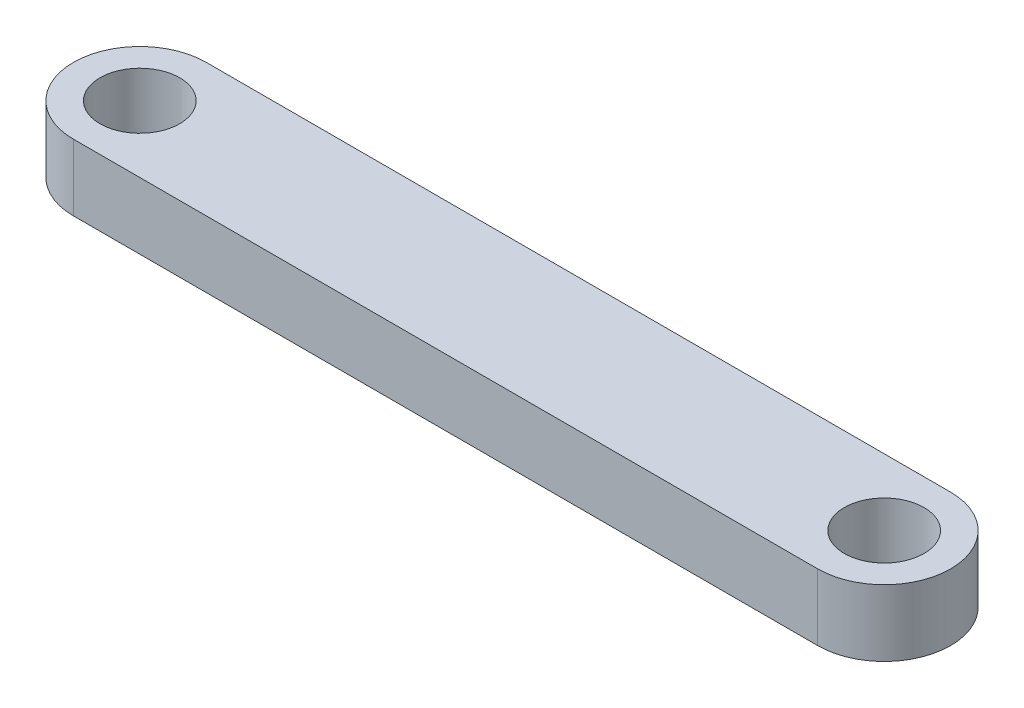
ISO-10303-21;
HEADER;
FILE_DESCRIPTION(('STEP AP214'),'2;1');
FILE_NAME('part.step','',(''),(''),'','','');
FILE_SCHEMA(('AUTOMOTIVE_DESIGN { 1 0 10303 214 1 1 1 1 }'));
ENDSEC;
DATA;
#1=APPLICATION_CONTEXT('core data for automotive mechanical design processes');
#2=APPLICATION_PROTOCOL_DEFINITION('international standard','automotive_design',2000,#1);
#3=PRODUCT_CONTEXT('',#1,'mechanical');
#4=PRODUCT('Part','Part','',(#3));
#5=PRODUCT_RELATED_PRODUCT_CATEGORY('part','',(#4));
#6=PRODUCT_DEFINITION_FORMATION('','',#4);
#7=PRODUCT_DEFINITION_CONTEXT('part definition',#1,'design');
#8=PRODUCT_DEFINITION('design','',#6,#7);
#9=PRODUCT_DEFINITION_SHAPE('','',#8);
#10=(LENGTH_UNIT() NAMED_UNIT(*) SI_UNIT(.MILLI.,.METRE.));
#11=(NAMED_UNIT(*) PLANE_ANGLE_UNIT() SI_UNIT($,.RADIAN.));
#12=(NAMED_UNIT(*) SI_UNIT($,.STERADIAN.) SOLID_ANGLE_UNIT());
#13=UNCERTAINTY_MEASURE_WITH_UNIT(LENGTH_MEASURE(1.E-05),#10,'distance_accuracy_value','');
#14=(GEOMETRIC_REPRESENTATION_CONTEXT(3) GLOBAL_UNCERTAINTY_ASSIGNED_CONTEXT((#13)) GLOBAL_UNIT_ASSIGNED_CONTEXT((#10,
#11,#12)) REPRESENTATION_CONTEXT('',''));
#15=CARTESIAN_POINT('',(0.,0.,0.));
#16=DIRECTION('',(0.,0.,1.));
#17=DIRECTION('',(1.,0.,0.));
#18=AXIS2_PLACEMENT_3D('',#15,#16,#17);
#19=CARTESIAN_POINT('',(-56.,5.,0.));
#20=DIRECTION('',(0.,-1.,0.));
#21=DIRECTION('',(0.,0.,-1.));
#22=AXIS2_PLACEMENT_3D('',#19,#20,#21);
#23=CYLINDRICAL_SURFACE('',#22,5.);
#24=CARTESIAN_POINT('',(-56.,0.,0.));
#25=DIRECTION('',(0.,1.,0.));
#26=DIRECTION('',(0.,0.,1.));
#27=AXIS2_PLACEMENT_3D('',#24,#25,#26);
#28=CIRCLE('',#27,5.);
#29=CARTESIAN_POINT('',(-56.,0.,-5.));
#30=VERTEX_POINT('',#29);
#31=CARTESIAN_POINT('',(-56.,0.,5.));
#32=VERTEX_POINT('',#31);
#33=EDGE_CURVE('E100',#30,#32,#28,.T.);
#34=ORIENTED_EDGE('',*,*,#33,.T.);
#35=DIRECTION('',(0.,-1.,0.));
#36=VECTOR('',#35,1.);
#37=CARTESIAN_POINT('',(-56.,5.,5.));
#38=LINE('',#37,#36);
#39=CARTESIAN_POINT('',(-56.,5.,5.));
#40=VERTEX_POINT('',#39);
#41=EDGE_CURVE('E11',#40,#32,#38,.T.);
#42=ORIENTED_EDGE('',*,*,#41,.F.);
#43=CARTESIAN_POINT('',(-56.,5.,0.));
#44=DIRECTION('',(0.,1.,0.));
#45=DIRECTION('',(0.,0.,1.));
#46=AXIS2_PLACEMENT_3D('',#43,#44,#45);
#47=CIRCLE('',#46,5.);
#48=CARTESIAN_POINT('',(-56.,5.,-5.));
#49=VERTEX_POINT('',#48);
#50=EDGE_CURVE('E86',#49,#40,#47,.T.);
#51=ORIENTED_EDGE('',*,*,#50,.F.);
#52=DIRECTION('',(0.,-1.,0.));
#53=VECTOR('',#52,1.);
#54=CARTESIAN_POINT('',(-56.,5.,-5.));
#55=LINE('',#54,#53);
#56=EDGE_CURVE('E53',#49,#30,#55,.T.);
#57=ORIENTED_EDGE('',*,*,#56,.T.);
#58=EDGE_LOOP('',(#34,#42,#51,#57));
#59=FACE_BOUND('',#58,.T.);
#60=ADVANCED_FACE('F37',(#59),#23,.T.);
#61=CARTESIAN_POINT('',(-56.,5.,5.));
#62=DIRECTION('',(0.,0.,-1.));
#63=DIRECTION('',(-1.,0.,0.));
#64=AXIS2_PLACEMENT_3D('',#61,#62,#63);
#65=PLANE('',#64);
#66=DIRECTION('',(1.,0.,0.));
#67=VECTOR('',#66,1.);
#68=CARTESIAN_POINT('',(-56.,0.,5.));
#69=LINE('',#68,#67);
#70=CARTESIAN_POINT('',(0.,0.,4.99999999999999));
#71=VERTEX_POINT('',#70);
#72=EDGE_CURVE('E91',#32,#71,#69,.T.);
#73=ORIENTED_EDGE('',*,*,#72,.T.);
#74=DIRECTION('',(0.,-1.,0.));
#75=VECTOR('',#74,1.);
#76=CARTESIAN_POINT('',(0.,5.,4.99999999999999));
#77=LINE('',#76,#75);
#78=CARTESIAN_POINT('',(0.,5.,4.99999999999999));
#79=VERTEX_POINT('',#78);
#80=EDGE_CURVE('E45',#79,#71,#77,.T.);
#81=ORIENTED_EDGE('',*,*,#80,.F.);
#82=DIRECTION('',(1.,0.,0.));
#83=VECTOR('',#82,1.);
#84=CARTESIAN_POINT('',(-56.,5.,5.));
#85=LINE('',#84,#83);
#86=EDGE_CURVE('E79',#40,#79,#85,.T.);
#87=ORIENTED_EDGE('',*,*,#86,.F.);
#88=ORIENTED_EDGE('',*,*,#41,.T.);
#89=EDGE_LOOP('',(#73,#81,#87,#88));
#90=FACE_BOUND('',#89,.T.);
#91=ADVANCED_FACE('F90',(#90),#65,.F.);
#92=CARTESIAN_POINT('',(0.,5.,0.));
#93=DIRECTION('',(0.,-1.,0.));
#94=DIRECTION('',(0.,0.,-1.));
#95=AXIS2_PLACEMENT_3D('',#92,#93,#94);
#96=CYLINDRICAL_SURFACE('',#95,5.);
#97=CARTESIAN_POINT('',(0.,0.,0.));
#98=DIRECTION('',(0.,1.,0.));
#99=DIRECTION('',(0.,0.,1.));
#100=AXIS2_PLACEMENT_3D('',#97,#98,#99);
#101=CIRCLE('',#100,5.);
#102=CARTESIAN_POINT('',(0.,0.,-5.));
#103=VERTEX_POINT('',#102);
#104=EDGE_CURVE('E104',#71,#103,#101,.T.);
#105=ORIENTED_EDGE('',*,*,#104,.T.);
#106=DIRECTION('',(0.,-1.,0.));
#107=VECTOR('',#106,1.);
#108=CARTESIAN_POINT('',(0.,5.,-5.));
#109=LINE('',#108,#107);
#110=CARTESIAN_POINT('',(0.,5.,-5.));
#111=VERTEX_POINT('',#110);
#112=EDGE_CURVE('E68',#111,#103,#109,.T.);
#113=ORIENTED_EDGE('',*,*,#112,.F.);
#114=CARTESIAN_POINT('',(0.,5.,0.));
#115=DIRECTION('',(0.,1.,0.));
#116=DIRECTION('',(0.,0.,1.));
#117=AXIS2_PLACEMENT_3D('',#114,#115,#116);
#118=CIRCLE('',#117,5.);
#119=EDGE_CURVE('E85',#79,#111,#118,.T.);
#120=ORIENTED_EDGE('',*,*,#119,.F.);
#121=ORIENTED_EDGE('',*,*,#80,.T.);
#122=EDGE_LOOP('',(#105,#113,#120,#121));
#123=FACE_BOUND('',#122,.T.);
#124=ADVANCED_FACE('F94',(#123),#96,.T.);
#125=CARTESIAN_POINT('',(-56.,5.,-5.));
#126=DIRECTION('',(0.,0.,-1.));
#127=DIRECTION('',(-1.,0.,0.));
#128=AXIS2_PLACEMENT_3D('',#125,#126,#127);
#129=PLANE('',#128);
#130=DIRECTION('',(1.,0.,0.));
#131=VECTOR('',#130,1.);
#132=CARTESIAN_POINT('',(-56.,0.,-5.));
#133=LINE('',#132,#131);
#134=EDGE_CURVE('E106',#30,#103,#133,.T.);
#135=ORIENTED_EDGE('',*,*,#134,.F.);
#136=ORIENTED_EDGE('',*,*,#56,.F.);
#137=DIRECTION('',(1.,0.,0.));
#138=VECTOR('',#137,1.);
#139=CARTESIAN_POINT('',(-56.,5.,-5.));
#140=LINE('',#139,#138);
#141=EDGE_CURVE('E95',#49,#111,#140,.T.);
#142=ORIENTED_EDGE('',*,*,#141,.T.);
#143=ORIENTED_EDGE('',*,*,#112,.T.);
#144=EDGE_LOOP('',(#135,#136,#142,#143));
#145=FACE_BOUND('',#144,.T.);
#146=ADVANCED_FACE('F138',(#145),#129,.T.);
#147=CARTESIAN_POINT('',(-56.,5.,0.));
#148=DIRECTION('',(0.,1.,0.));
#149=DIRECTION('',(0.,0.,1.));
#150=AXIS2_PLACEMENT_3D('',#147,#148,#149);
#151=PLANE('',#150);
#152=CARTESIAN_POINT('',(0.,5.,0.));
#153=DIRECTION('',(0.,-1.,0.));
#154=DIRECTION('',(0.,0.,-1.));
#155=AXIS2_PLACEMENT_3D('',#152,#153,#154);
#156=CIRCLE('',#155,3.);
#157=CARTESIAN_POINT('',(0.,5.,-3.));
#158=VERTEX_POINT('',#157);
#159=EDGE_CURVE('E115',#158,#158,#156,.T.);
#160=ORIENTED_EDGE('',*,*,#159,.T.);
#161=EDGE_LOOP('',(#160));
#162=FACE_BOUND('',#161,.T.);
#163=CARTESIAN_POINT('',(-56.,5.,0.));
#164=DIRECTION('',(0.,1.,0.));
#165=DIRECTION('',(0.,0.,1.));
#166=AXIS2_PLACEMENT_3D('',#163,#164,#165);
#167=CIRCLE('',#166,3.);
#168=CARTESIAN_POINT('',(-56.,5.,3.00000000000001));
#169=VERTEX_POINT('',#168);
#170=EDGE_CURVE('E102',#169,#169,#167,.T.);
#171=ORIENTED_EDGE('',*,*,#170,.F.);
#172=EDGE_LOOP('',(#171));
#173=FACE_BOUND('',#172,.T.);
#174=ORIENTED_EDGE('',*,*,#50,.T.);
#175=ORIENTED_EDGE('',*,*,#86,.T.);
#176=ORIENTED_EDGE('',*,*,#119,.T.);
#177=ORIENTED_EDGE('',*,*,#141,.F.);
#178=EDGE_LOOP('',(#174,#175,#176,#177));
#179=FACE_BOUND('',#178,.T.);
#180=ADVANCED_FACE('F82',(#162,#173,#179),#151,.T.);
#181=CARTESIAN_POINT('',(-56.,0.,0.));
#182=DIRECTION('',(0.,1.,0.));
#183=DIRECTION('',(0.,0.,1.));
#184=AXIS2_PLACEMENT_3D('',#181,#182,#183);
#185=PLANE('',#184);
#186=CARTESIAN_POINT('',(0.,0.,0.));
#187=DIRECTION('',(0.,-1.,0.));
#188=DIRECTION('',(0.,0.,-1.));
#189=AXIS2_PLACEMENT_3D('',#186,#187,#188);
#190=CIRCLE('',#189,3.);
#191=CARTESIAN_POINT('',(0.,0.,-3.));
#192=VERTEX_POINT('',#191);
#193=EDGE_CURVE('E118',#192,#192,#190,.T.);
#194=ORIENTED_EDGE('',*,*,#193,.F.);
#195=EDGE_LOOP('',(#194));
#196=FACE_BOUND('',#195,.T.);
#197=CARTESIAN_POINT('',(-56.,0.,0.));
#198=DIRECTION('',(0.,1.,0.));
#199=DIRECTION('',(0.,0.,1.));
#200=AXIS2_PLACEMENT_3D('',#197,#198,#199);
#201=CIRCLE('',#200,3.);
#202=CARTESIAN_POINT('',(-56.,0.,3.00000000000001));
#203=VERTEX_POINT('',#202);
#204=EDGE_CURVE('E112',#203,#203,#201,.T.);
#205=ORIENTED_EDGE('',*,*,#204,.T.);
#206=EDGE_LOOP('',(#205));
#207=FACE_BOUND('',#206,.T.);
#208=ORIENTED_EDGE('',*,*,#33,.F.);
#209=ORIENTED_EDGE('',*,*,#134,.T.);
#210=ORIENTED_EDGE('',*,*,#104,.F.);
#211=ORIENTED_EDGE('',*,*,#72,.F.);
#212=EDGE_LOOP('',(#208,#209,#210,#211));
#213=FACE_BOUND('',#212,.T.);
#214=ADVANCED_FACE('F133',(#196,#207,#213),#185,.F.);
#215=CARTESIAN_POINT('',(-56.,5.,0.));
#216=DIRECTION('',(0.,-1.,0.));
#217=DIRECTION('',(0.,0.,-1.));
#218=AXIS2_PLACEMENT_3D('',#215,#216,#217);
#219=CYLINDRICAL_SURFACE('',#218,3.);
#220=ORIENTED_EDGE('',*,*,#170,.T.);
#221=EDGE_LOOP('',(#220));
#222=FACE_BOUND('',#221,.T.);
#223=ORIENTED_EDGE('',*,*,#204,.F.);
#224=EDGE_LOOP('',(#223));
#225=FACE_BOUND('',#224,.T.);
#226=ADVANCED_FACE('F129',(#222,#225),#219,.F.);
#227=CARTESIAN_POINT('',(0.,5.,0.));
#228=DIRECTION('',(0.,-1.,0.));
#229=DIRECTION('',(0.,0.,-1.));
#230=AXIS2_PLACEMENT_3D('',#227,#228,#229);
#231=CYLINDRICAL_SURFACE('',#230,3.);
#232=ORIENTED_EDGE('',*,*,#159,.F.);
#233=EDGE_LOOP('',(#232));
#234=FACE_BOUND('',#233,.T.);
#235=ORIENTED_EDGE('',*,*,#193,.T.);
#236=EDGE_LOOP('',(#235));
#237=FACE_BOUND('',#236,.T.);
#238=ADVANCED_FACE('F126',(#234,#237),#231,.F.);
#239=CLOSED_SHELL('',(#60,#91,#124,#146,#180,#214,#226,#238));
#240=MANIFOLD_SOLID_BREP('B2',#239);
#241=ADVANCED_BREP_SHAPE_REPRESENTATION('',(#18,#240),#14);
#242=SHAPE_DEFINITION_REPRESENTATION(#9,#241);
ENDSEC;
END-ISO-10303-21;
